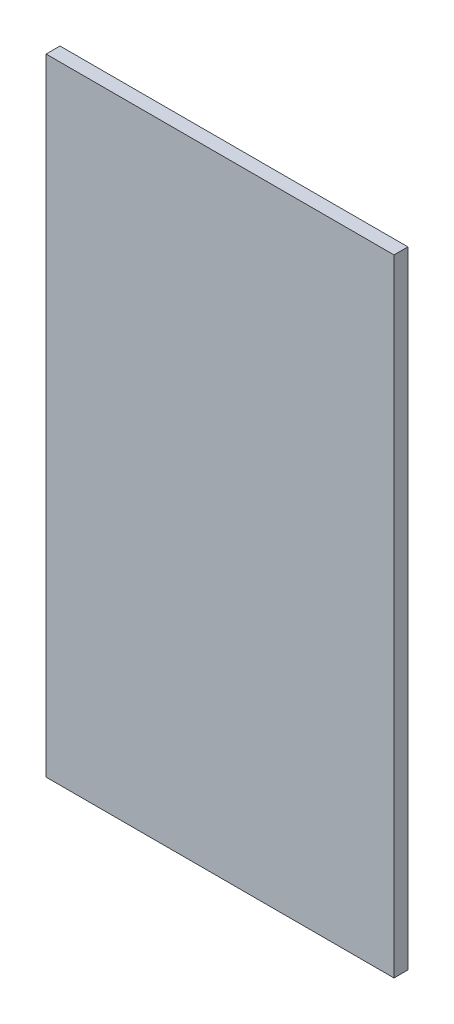
ISO-10303-21;
HEADER;
FILE_DESCRIPTION(('STEP AP214'),'2;1');
FILE_NAME('part.step','',(''),(''),'','','');
FILE_SCHEMA(('AUTOMOTIVE_DESIGN { 1 0 10303 214 1 1 1 1 }'));
ENDSEC;
DATA;
#1=APPLICATION_CONTEXT('core data for automotive mechanical design processes');
#2=APPLICATION_PROTOCOL_DEFINITION('international standard','automotive_design',2000,#1);
#3=PRODUCT_CONTEXT('',#1,'mechanical');
#4=PRODUCT('Part','Part','',(#3));
#5=PRODUCT_RELATED_PRODUCT_CATEGORY('part','',(#4));
#6=PRODUCT_DEFINITION_FORMATION('','',#4);
#7=PRODUCT_DEFINITION_CONTEXT('part definition',#1,'design');
#8=PRODUCT_DEFINITION('design','',#6,#7);
#9=PRODUCT_DEFINITION_SHAPE('','',#8);
#10=(LENGTH_UNIT() NAMED_UNIT(*) SI_UNIT(.MILLI.,.METRE.));
#11=(NAMED_UNIT(*) PLANE_ANGLE_UNIT() SI_UNIT($,.RADIAN.));
#12=(NAMED_UNIT(*) SI_UNIT($,.STERADIAN.) SOLID_ANGLE_UNIT());
#13=UNCERTAINTY_MEASURE_WITH_UNIT(LENGTH_MEASURE(1.E-05),#10,'distance_accuracy_value','');
#14=(GEOMETRIC_REPRESENTATION_CONTEXT(3) GLOBAL_UNCERTAINTY_ASSIGNED_CONTEXT((#13)) GLOBAL_UNIT_ASSIGNED_CONTEXT((#10,
#11,#12)) REPRESENTATION_CONTEXT('',''));
#15=CARTESIAN_POINT('',(0.,0.,0.));
#16=DIRECTION('',(0.,0.,1.));
#17=DIRECTION('',(1.,0.,0.));
#18=AXIS2_PLACEMENT_3D('',#15,#16,#17);
#19=CARTESIAN_POINT('',(250.,-450.,20.));
#20=DIRECTION('',(-1.,0.,0.));
#21=DIRECTION('',(0.,0.,1.));
#22=AXIS2_PLACEMENT_3D('',#19,#20,#21);
#23=PLANE('',#22);
#24=DIRECTION('',(0.,1.,0.));
#25=VECTOR('',#24,1.);
#26=CARTESIAN_POINT('',(250.,-450.,0.));
#27=LINE('',#26,#25);
#28=CARTESIAN_POINT('',(250.,-450.,0.));
#29=VERTEX_POINT('',#28);
#30=CARTESIAN_POINT('',(250.,450.,0.));
#31=VERTEX_POINT('',#30);
#32=EDGE_CURVE('E98',#29,#31,#27,.T.);
#33=ORIENTED_EDGE('',*,*,#32,.T.);
#34=DIRECTION('',(0.,0.,-1.));
#35=VECTOR('',#34,1.);
#36=CARTESIAN_POINT('',(250.,450.,20.));
#37=LINE('',#36,#35);
#38=CARTESIAN_POINT('',(250.,450.,20.));
#39=VERTEX_POINT('',#38);
#40=EDGE_CURVE('E11',#39,#31,#37,.T.);
#41=ORIENTED_EDGE('',*,*,#40,.F.);
#42=DIRECTION('',(0.,1.,0.));
#43=VECTOR('',#42,1.);
#44=CARTESIAN_POINT('',(250.,-450.,20.));
#45=LINE('',#44,#43);
#46=CARTESIAN_POINT('',(250.,-450.,20.));
#47=VERTEX_POINT('',#46);
#48=EDGE_CURVE('E86',#47,#39,#45,.T.);
#49=ORIENTED_EDGE('',*,*,#48,.F.);
#50=DIRECTION('',(0.,0.,-1.));
#51=VECTOR('',#50,1.);
#52=CARTESIAN_POINT('',(250.,-450.,20.));
#53=LINE('',#52,#51);
#54=EDGE_CURVE('E94',#47,#29,#53,.T.);
#55=ORIENTED_EDGE('',*,*,#54,.T.);
#56=EDGE_LOOP('',(#33,#41,#49,#55));
#57=FACE_BOUND('',#56,.T.);
#58=ADVANCED_FACE('F35',(#57),#23,.F.);
#59=CARTESIAN_POINT('',(-250.,450.,20.));
#60=DIRECTION('',(0.,-1.,0.));
#61=DIRECTION('',(0.,0.,-1.));
#62=AXIS2_PLACEMENT_3D('',#59,#60,#61);
#63=PLANE('',#62);
#64=DIRECTION('',(-1.,0.,0.));
#65=VECTOR('',#64,1.);
#66=CARTESIAN_POINT('',(-250.,450.,0.));
#67=LINE('',#66,#65);
#68=CARTESIAN_POINT('',(-250.,450.,0.));
#69=VERTEX_POINT('',#68);
#70=EDGE_CURVE('E90',#31,#69,#67,.T.);
#71=ORIENTED_EDGE('',*,*,#70,.T.);
#72=DIRECTION('',(0.,0.,-1.));
#73=VECTOR('',#72,1.);
#74=CARTESIAN_POINT('',(-250.,450.,20.));
#75=LINE('',#74,#73);
#76=CARTESIAN_POINT('',(-250.,450.,20.));
#77=VERTEX_POINT('',#76);
#78=EDGE_CURVE('E43',#77,#69,#75,.T.);
#79=ORIENTED_EDGE('',*,*,#78,.F.);
#80=DIRECTION('',(-1.,0.,0.));
#81=VECTOR('',#80,1.);
#82=CARTESIAN_POINT('',(-250.,450.,20.));
#83=LINE('',#82,#81);
#84=EDGE_CURVE('E81',#39,#77,#83,.T.);
#85=ORIENTED_EDGE('',*,*,#84,.F.);
#86=ORIENTED_EDGE('',*,*,#40,.T.);
#87=EDGE_LOOP('',(#71,#79,#85,#86));
#88=FACE_BOUND('',#87,.T.);
#89=ADVANCED_FACE('F89',(#88),#63,.F.);
#90=CARTESIAN_POINT('',(-250.,-450.,20.));
#91=DIRECTION('',(1.,0.,0.));
#92=DIRECTION('',(0.,0.,-1.));
#93=AXIS2_PLACEMENT_3D('',#90,#91,#92);
#94=PLANE('',#93);
#95=DIRECTION('',(0.,-1.,0.));
#96=VECTOR('',#95,1.);
#97=CARTESIAN_POINT('',(-250.,-450.,0.));
#98=LINE('',#97,#96);
#99=CARTESIAN_POINT('',(-250.,-450.,0.));
#100=VERTEX_POINT('',#99);
#101=EDGE_CURVE('E68',#69,#100,#98,.T.);
#102=ORIENTED_EDGE('',*,*,#101,.T.);
#103=DIRECTION('',(0.,0.,-1.));
#104=VECTOR('',#103,1.);
#105=CARTESIAN_POINT('',(-250.,-450.,20.));
#106=LINE('',#105,#104);
#107=CARTESIAN_POINT('',(-250.,-450.,20.));
#108=VERTEX_POINT('',#107);
#109=EDGE_CURVE('E91',#108,#100,#106,.T.);
#110=ORIENTED_EDGE('',*,*,#109,.F.);
#111=DIRECTION('',(0.,-1.,0.));
#112=VECTOR('',#111,1.);
#113=CARTESIAN_POINT('',(-250.,-450.,20.));
#114=LINE('',#113,#112);
#115=EDGE_CURVE('E84',#77,#108,#114,.T.);
#116=ORIENTED_EDGE('',*,*,#115,.F.);
#117=ORIENTED_EDGE('',*,*,#78,.T.);
#118=EDGE_LOOP('',(#102,#110,#116,#117));
#119=FACE_BOUND('',#118,.T.);
#120=ADVANCED_FACE('F92',(#119),#94,.F.);
#121=CARTESIAN_POINT('',(-250.,-450.,20.));
#122=DIRECTION('',(0.,1.,0.));
#123=DIRECTION('',(0.,0.,1.));
#124=AXIS2_PLACEMENT_3D('',#121,#122,#123);
#125=PLANE('',#124);
#126=DIRECTION('',(1.,0.,0.));
#127=VECTOR('',#126,1.);
#128=CARTESIAN_POINT('',(-250.,-450.,0.));
#129=LINE('',#128,#127);
#130=EDGE_CURVE('E74',#100,#29,#129,.T.);
#131=ORIENTED_EDGE('',*,*,#130,.T.);
#132=ORIENTED_EDGE('',*,*,#54,.F.);
#133=DIRECTION('',(1.,0.,0.));
#134=VECTOR('',#133,1.);
#135=CARTESIAN_POINT('',(-250.,-450.,20.));
#136=LINE('',#135,#134);
#137=EDGE_CURVE('E51',#108,#47,#136,.T.);
#138=ORIENTED_EDGE('',*,*,#137,.F.);
#139=ORIENTED_EDGE('',*,*,#109,.T.);
#140=EDGE_LOOP('',(#131,#132,#138,#139));
#141=FACE_BOUND('',#140,.T.);
#142=ADVANCED_FACE('F105',(#141),#125,.F.);
#143=CARTESIAN_POINT('',(0.,0.,20.));
#144=DIRECTION('',(0.,0.,-1.));
#145=DIRECTION('',(-1.,0.,0.));
#146=AXIS2_PLACEMENT_3D('',#143,#144,#145);
#147=PLANE('',#146);
#148=ORIENTED_EDGE('',*,*,#48,.T.);
#149=ORIENTED_EDGE('',*,*,#84,.T.);
#150=ORIENTED_EDGE('',*,*,#115,.T.);
#151=ORIENTED_EDGE('',*,*,#137,.T.);
#152=EDGE_LOOP('',(#148,#149,#150,#151));
#153=FACE_BOUND('',#152,.T.);
#154=ADVANCED_FACE('F82',(#153),#147,.F.);
#155=CARTESIAN_POINT('',(0.,0.,0.));
#156=DIRECTION('',(0.,0.,-1.));
#157=DIRECTION('',(-1.,0.,0.));
#158=AXIS2_PLACEMENT_3D('',#155,#156,#157);
#159=PLANE('',#158);
#160=ORIENTED_EDGE('',*,*,#32,.F.);
#161=ORIENTED_EDGE('',*,*,#130,.F.);
#162=ORIENTED_EDGE('',*,*,#101,.F.);
#163=ORIENTED_EDGE('',*,*,#70,.F.);
#164=EDGE_LOOP('',(#160,#161,#162,#163));
#165=FACE_BOUND('',#164,.T.);
#166=ADVANCED_FACE('F108',(#165),#159,.T.);
#167=CLOSED_SHELL('',(#58,#89,#120,#142,#154,#166));
#168=MANIFOLD_SOLID_BREP('B2',#167);
#169=ADVANCED_BREP_SHAPE_REPRESENTATION('',(#18,#168),#14);
#170=SHAPE_DEFINITION_REPRESENTATION(#9,#169);
ENDSEC;
END-ISO-10303-21;
